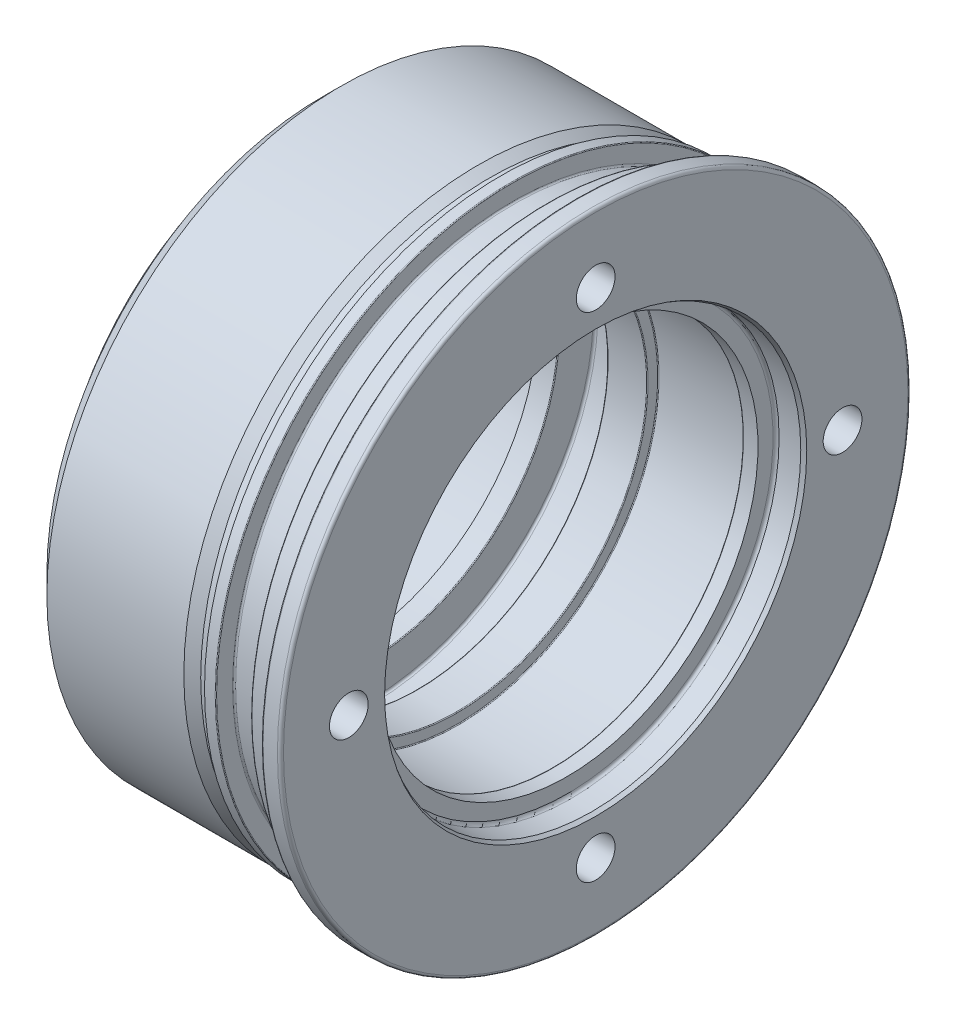
ISO-10303-21;
HEADER;
FILE_DESCRIPTION(('STEP AP214'),'2;1');
FILE_NAME('part.step','',(''),(''),'','','');
FILE_SCHEMA(('AUTOMOTIVE_DESIGN { 1 0 10303 214 1 1 1 1 }'));
ENDSEC;
DATA;
#1=APPLICATION_CONTEXT('core data for automotive mechanical design processes');
#2=APPLICATION_PROTOCOL_DEFINITION('international standard','automotive_design',2000,#1);
#3=PRODUCT_CONTEXT('',#1,'mechanical');
#4=PRODUCT('Part','Part','',(#3));
#5=PRODUCT_RELATED_PRODUCT_CATEGORY('part','',(#4));
#6=PRODUCT_DEFINITION_FORMATION('','',#4);
#7=PRODUCT_DEFINITION_CONTEXT('part definition',#1,'design');
#8=PRODUCT_DEFINITION('design','',#6,#7);
#9=PRODUCT_DEFINITION_SHAPE('','',#8);
#10=(LENGTH_UNIT() NAMED_UNIT(*) SI_UNIT(.MILLI.,.METRE.));
#11=(NAMED_UNIT(*) PLANE_ANGLE_UNIT() SI_UNIT($,.RADIAN.));
#12=(NAMED_UNIT(*) SI_UNIT($,.STERADIAN.) SOLID_ANGLE_UNIT());
#13=UNCERTAINTY_MEASURE_WITH_UNIT(LENGTH_MEASURE(1.E-05),#10,'distance_accuracy_value','');
#14=(GEOMETRIC_REPRESENTATION_CONTEXT(3) GLOBAL_UNCERTAINTY_ASSIGNED_CONTEXT((#13)) GLOBAL_UNIT_ASSIGNED_CONTEXT((#10,
#11,#12)) REPRESENTATION_CONTEXT('',''));
#15=CARTESIAN_POINT('',(0.,0.,0.));
#16=DIRECTION('',(0.,0.,1.));
#17=DIRECTION('',(1.,0.,0.));
#18=AXIS2_PLACEMENT_3D('',#15,#16,#17);
#19=CARTESIAN_POINT('',(-77.5,0.,0.));
#20=DIRECTION('',(-1.,0.,0.));
#21=DIRECTION('',(0.,0.,1.));
#22=AXIS2_PLACEMENT_3D('',#19,#20,#21);
#23=CYLINDRICAL_SURFACE('',#22,76.);
#24=CARTESIAN_POINT('',(-28.,0.,0.));
#25=DIRECTION('',(-1.,0.,0.));
#26=DIRECTION('',(0.,0.,1.));
#27=AXIS2_PLACEMENT_3D('',#24,#25,#26);
#28=CIRCLE('',#27,76.);
#29=CARTESIAN_POINT('',(-28.,0.,76.));
#30=VERTEX_POINT('',#29);
#31=EDGE_CURVE('E11',#30,#30,#28,.T.);
#32=ORIENTED_EDGE('',*,*,#31,.F.);
#33=EDGE_LOOP('',(#32));
#34=FACE_BOUND('',#33,.T.);
#35=CARTESIAN_POINT('',(-25.,0.,0.));
#36=DIRECTION('',(-1.,0.,0.));
#37=DIRECTION('',(0.,0.,1.));
#38=AXIS2_PLACEMENT_3D('',#35,#36,#37);
#39=CIRCLE('',#38,76.);
#40=CARTESIAN_POINT('',(-25.,0.,76.));
#41=VERTEX_POINT('',#40);
#42=EDGE_CURVE('E98',#41,#41,#39,.T.);
#43=ORIENTED_EDGE('',*,*,#42,.T.);
#44=EDGE_LOOP('',(#43));
#45=FACE_BOUND('',#44,.T.);
#46=ADVANCED_FACE('F45',(#34,#45),#23,.T.);
#47=CARTESIAN_POINT('',(-28.,0.,0.));
#48=DIRECTION('',(-1.,0.,0.));
#49=DIRECTION('',(0.,0.,1.));
#50=AXIS2_PLACEMENT_3D('',#47,#48,#49);
#51=CONICAL_SURFACE('',#50,76.,0.471238898038469);
#52=CARTESIAN_POINT('',(-30.9439157582577,0.,0.));
#53=DIRECTION('',(-1.,0.,0.));
#54=DIRECTION('',(0.,0.,1.));
#55=AXIS2_PLACEMENT_3D('',#52,#53,#54);
#56=CIRCLE('',#55,77.5);
#57=CARTESIAN_POINT('',(-30.9439157582577,0.,77.5));
#58=VERTEX_POINT('',#57);
#59=EDGE_CURVE('E52',#58,#58,#56,.T.);
#60=ORIENTED_EDGE('',*,*,#59,.F.);
#61=EDGE_LOOP('',(#60));
#62=FACE_BOUND('',#61,.T.);
#63=ORIENTED_EDGE('',*,*,#31,.T.);
#64=EDGE_LOOP('',(#63));
#65=FACE_BOUND('',#64,.T.);
#66=ADVANCED_FACE('F234',(#62,#65),#51,.T.);
#67=CARTESIAN_POINT('',(-77.5,0.,0.));
#68=DIRECTION('',(-1.,0.,0.));
#69=DIRECTION('',(0.,0.,1.));
#70=AXIS2_PLACEMENT_3D('',#67,#68,#69);
#71=CYLINDRICAL_SURFACE('',#70,77.5);
#72=CARTESIAN_POINT('',(-66.9999999999999,0.,0.));
#73=DIRECTION('',(-1.,0.,0.));
#74=DIRECTION('',(0.,0.,1.));
#75=AXIS2_PLACEMENT_3D('',#72,#73,#74);
#76=CIRCLE('',#75,77.5);
#77=CARTESIAN_POINT('',(-66.9999999999999,0.,77.5));
#78=VERTEX_POINT('',#77);
#79=EDGE_CURVE('E227',#78,#78,#76,.T.);
#80=ORIENTED_EDGE('',*,*,#79,.F.);
#81=EDGE_LOOP('',(#80));
#82=FACE_BOUND('',#81,.T.);
#83=ORIENTED_EDGE('',*,*,#59,.T.);
#84=EDGE_LOOP('',(#83));
#85=FACE_BOUND('',#84,.T.);
#86=ADVANCED_FACE('F232',(#82,#85),#71,.T.);
#87=CARTESIAN_POINT('',(-72.,0.,0.));
#88=DIRECTION('',(1.,0.,0.));
#89=DIRECTION('',(0.,0.,-1.));
#90=AXIS2_PLACEMENT_3D('',#87,#88,#89);
#91=CONICAL_SURFACE('',#90,72.5,0.785398163397444);
#92=ORIENTED_EDGE('',*,*,#79,.T.);
#93=EDGE_LOOP('',(#92));
#94=FACE_BOUND('',#93,.T.);
#95=CARTESIAN_POINT('',(-72.,0.,0.));
#96=DIRECTION('',(-1.,0.,0.));
#97=DIRECTION('',(0.,0.,1.));
#98=AXIS2_PLACEMENT_3D('',#95,#96,#97);
#99=CIRCLE('',#98,72.5);
#100=CARTESIAN_POINT('',(-72.,0.,72.5));
#101=VERTEX_POINT('',#100);
#102=EDGE_CURVE('E224',#101,#101,#99,.T.);
#103=ORIENTED_EDGE('',*,*,#102,.F.);
#104=EDGE_LOOP('',(#103));
#105=FACE_BOUND('',#104,.T.);
#106=ADVANCED_FACE('F432',(#94,#105),#91,.T.);
#107=CARTESIAN_POINT('',(-72.,65.,0.));
#108=DIRECTION('',(-1.,0.,0.));
#109=DIRECTION('',(0.,0.,1.));
#110=AXIS2_PLACEMENT_3D('',#107,#108,#109);
#111=PLANE('',#110);
#112=ORIENTED_EDGE('',*,*,#102,.T.);
#113=EDGE_LOOP('',(#112));
#114=FACE_BOUND('',#113,.T.);
#115=CARTESIAN_POINT('',(-72.,0.,0.));
#116=DIRECTION('',(-1.,0.,0.));
#117=DIRECTION('',(0.,0.,1.));
#118=AXIS2_PLACEMENT_3D('',#115,#116,#117);
#119=CIRCLE('',#118,65.);
#120=CARTESIAN_POINT('',(-72.,0.,65.));
#121=VERTEX_POINT('',#120);
#122=EDGE_CURVE('E221',#121,#121,#119,.T.);
#123=ORIENTED_EDGE('',*,*,#122,.F.);
#124=EDGE_LOOP('',(#123));
#125=FACE_BOUND('',#124,.T.);
#126=ADVANCED_FACE('F428',(#114,#125),#111,.T.);
#127=CARTESIAN_POINT('',(-77.5,0.,0.));
#128=DIRECTION('',(-1.,0.,0.));
#129=DIRECTION('',(0.,0.,1.));
#130=AXIS2_PLACEMENT_3D('',#127,#128,#129);
#131=CYLINDRICAL_SURFACE('',#130,65.);
#132=ORIENTED_EDGE('',*,*,#122,.T.);
#133=EDGE_LOOP('',(#132));
#134=FACE_BOUND('',#133,.T.);
#135=CARTESIAN_POINT('',(-77.5,0.,0.));
#136=DIRECTION('',(-1.,0.,0.));
#137=DIRECTION('',(0.,0.,1.));
#138=AXIS2_PLACEMENT_3D('',#135,#136,#137);
#139=CIRCLE('',#138,65.);
#140=CARTESIAN_POINT('',(-77.5,0.,65.));
#141=VERTEX_POINT('',#140);
#142=EDGE_CURVE('E218',#141,#141,#139,.T.);
#143=ORIENTED_EDGE('',*,*,#142,.F.);
#144=EDGE_LOOP('',(#143));
#145=FACE_BOUND('',#144,.T.);
#146=ADVANCED_FACE('F424',(#134,#145),#131,.T.);
#147=CARTESIAN_POINT('',(-77.5,65.,0.));
#148=DIRECTION('',(1.,0.,0.));
#149=DIRECTION('',(0.,0.,-1.));
#150=AXIS2_PLACEMENT_3D('',#147,#148,#149);
#151=PLANE('',#150);
#152=CARTESIAN_POINT('',(-77.5,0.,0.));
#153=DIRECTION('',(-1.,0.,0.));
#154=DIRECTION('',(0.,0.,1.));
#155=AXIS2_PLACEMENT_3D('',#152,#153,#154);
#156=CIRCLE('',#155,52.);
#157=CARTESIAN_POINT('',(-77.5,0.,52.));
#158=VERTEX_POINT('',#157);
#159=EDGE_CURVE('E215',#158,#158,#156,.T.);
#160=ORIENTED_EDGE('',*,*,#159,.F.);
#161=EDGE_LOOP('',(#160));
#162=FACE_BOUND('',#161,.T.);
#163=ORIENTED_EDGE('',*,*,#142,.T.);
#164=EDGE_LOOP('',(#163));
#165=FACE_BOUND('',#164,.T.);
#166=ADVANCED_FACE('F420',(#162,#165),#151,.F.);
#167=CARTESIAN_POINT('',(-77.5,0.,0.));
#168=DIRECTION('',(-1.,0.,0.));
#169=DIRECTION('',(0.,0.,1.));
#170=AXIS2_PLACEMENT_3D('',#167,#168,#169);
#171=CYLINDRICAL_SURFACE('',#170,52.);
#172=CARTESIAN_POINT('',(-65.5,0.,0.));
#173=DIRECTION('',(-1.,0.,0.));
#174=DIRECTION('',(0.,0.,1.));
#175=AXIS2_PLACEMENT_3D('',#172,#173,#174);
#176=CIRCLE('',#175,52.);
#177=CARTESIAN_POINT('',(-65.5,0.,52.));
#178=VERTEX_POINT('',#177);
#179=EDGE_CURVE('E212',#178,#178,#176,.T.);
#180=ORIENTED_EDGE('',*,*,#179,.F.);
#181=EDGE_LOOP('',(#180));
#182=FACE_BOUND('',#181,.T.);
#183=ORIENTED_EDGE('',*,*,#159,.T.);
#184=EDGE_LOOP('',(#183));
#185=FACE_BOUND('',#184,.T.);
#186=ADVANCED_FACE('F416',(#182,#185),#171,.F.);
#187=CARTESIAN_POINT('',(-65.5,52.,0.));
#188=DIRECTION('',(1.,0.,0.));
#189=DIRECTION('',(0.,0.,-1.));
#190=AXIS2_PLACEMENT_3D('',#187,#188,#189);
#191=PLANE('',#190);
#192=CARTESIAN_POINT('',(-65.5,0.,0.));
#193=DIRECTION('',(-1.,0.,0.));
#194=DIRECTION('',(0.,0.,1.));
#195=AXIS2_PLACEMENT_3D('',#192,#193,#194);
#196=CIRCLE('',#195,50.25);
#197=CARTESIAN_POINT('',(-65.5,0.,50.25));
#198=VERTEX_POINT('',#197);
#199=EDGE_CURVE('E209',#198,#198,#196,.T.);
#200=ORIENTED_EDGE('',*,*,#199,.F.);
#201=EDGE_LOOP('',(#200));
#202=FACE_BOUND('',#201,.T.);
#203=ORIENTED_EDGE('',*,*,#179,.T.);
#204=EDGE_LOOP('',(#203));
#205=FACE_BOUND('',#204,.T.);
#206=ADVANCED_FACE('F412',(#202,#205),#191,.F.);
#207=CARTESIAN_POINT('',(-77.5,0.,0.));
#208=DIRECTION('',(-1.,0.,0.));
#209=DIRECTION('',(0.,0.,1.));
#210=AXIS2_PLACEMENT_3D('',#207,#208,#209);
#211=CYLINDRICAL_SURFACE('',#210,50.25);
#212=CARTESIAN_POINT('',(-60.2,0.,0.));
#213=DIRECTION('',(-1.,0.,0.));
#214=DIRECTION('',(0.,0.,1.));
#215=AXIS2_PLACEMENT_3D('',#212,#213,#214);
#216=CIRCLE('',#215,50.25);
#217=CARTESIAN_POINT('',(-60.2,0.,50.25));
#218=VERTEX_POINT('',#217);
#219=EDGE_CURVE('E206',#218,#218,#216,.T.);
#220=ORIENTED_EDGE('',*,*,#219,.F.);
#221=EDGE_LOOP('',(#220));
#222=FACE_BOUND('',#221,.T.);
#223=ORIENTED_EDGE('',*,*,#199,.T.);
#224=EDGE_LOOP('',(#223));
#225=FACE_BOUND('',#224,.T.);
#226=ADVANCED_FACE('F408',(#222,#225),#211,.F.);
#227=CARTESIAN_POINT('',(-60.2,0.,0.));
#228=DIRECTION('',(-1.,0.,0.));
#229=DIRECTION('',(0.,0.,1.));
#230=AXIS2_PLACEMENT_3D('',#227,#228,#229);
#231=TOROIDAL_SURFACE('',#230,50.45,0.199999999999999);
#232=CARTESIAN_POINT('',(-60.,0.,0.));
#233=DIRECTION('',(-1.,0.,0.));
#234=DIRECTION('',(0.,0.,1.));
#235=AXIS2_PLACEMENT_3D('',#232,#233,#234);
#236=CIRCLE('',#235,50.45);
#237=CARTESIAN_POINT('',(-60.,0.,50.45));
#238=VERTEX_POINT('',#237);
#239=EDGE_CURVE('E203',#238,#238,#236,.T.);
#240=ORIENTED_EDGE('',*,*,#239,.F.);
#241=EDGE_LOOP('',(#240));
#242=FACE_BOUND('',#241,.T.);
#243=ORIENTED_EDGE('',*,*,#219,.T.);
#244=EDGE_LOOP('',(#243));
#245=FACE_BOUND('',#244,.T.);
#246=ADVANCED_FACE('F404',(#242,#245),#231,.T.);
#247=CARTESIAN_POINT('',(-60.,50.45,0.));
#248=DIRECTION('',(-1.,0.,0.));
#249=DIRECTION('',(0.,0.,1.));
#250=AXIS2_PLACEMENT_3D('',#247,#248,#249);
#251=PLANE('',#250);
#252=CARTESIAN_POINT('',(-60.,0.,0.));
#253=DIRECTION('',(-1.,0.,0.));
#254=DIRECTION('',(0.,0.,1.));
#255=AXIS2_PLACEMENT_3D('',#252,#253,#254);
#256=CIRCLE('',#255,59.4);
#257=CARTESIAN_POINT('',(-60.,0.,59.4));
#258=VERTEX_POINT('',#257);
#259=EDGE_CURVE('E200',#258,#258,#256,.T.);
#260=ORIENTED_EDGE('',*,*,#259,.F.);
#261=EDGE_LOOP('',(#260));
#262=FACE_BOUND('',#261,.T.);
#263=ORIENTED_EDGE('',*,*,#239,.T.);
#264=EDGE_LOOP('',(#263));
#265=FACE_BOUND('',#264,.T.);
#266=ADVANCED_FACE('F400',(#262,#265),#251,.F.);
#267=CARTESIAN_POINT('',(-59.4,0.,0.));
#268=DIRECTION('',(-1.,0.,0.));
#269=DIRECTION('',(0.,0.,1.));
#270=AXIS2_PLACEMENT_3D('',#267,#268,#269);
#271=TOROIDAL_SURFACE('',#270,59.4,0.600000000000003);
#272=CARTESIAN_POINT('',(-59.4,0.,0.));
#273=DIRECTION('',(-1.,0.,0.));
#274=DIRECTION('',(0.,0.,1.));
#275=AXIS2_PLACEMENT_3D('',#272,#273,#274);
#276=CIRCLE('',#275,60.);
#277=CARTESIAN_POINT('',(-59.4,0.,60.));
#278=VERTEX_POINT('',#277);
#279=EDGE_CURVE('E197',#278,#278,#276,.T.);
#280=ORIENTED_EDGE('',*,*,#279,.F.);
#281=EDGE_LOOP('',(#280));
#282=FACE_BOUND('',#281,.T.);
#283=ORIENTED_EDGE('',*,*,#259,.T.);
#284=EDGE_LOOP('',(#283));
#285=FACE_BOUND('',#284,.T.);
#286=ADVANCED_FACE('F396',(#282,#285),#271,.F.);
#287=CARTESIAN_POINT('',(-77.5,0.,0.));
#288=DIRECTION('',(-1.,0.,0.));
#289=DIRECTION('',(0.,0.,1.));
#290=AXIS2_PLACEMENT_3D('',#287,#288,#289);
#291=CYLINDRICAL_SURFACE('',#290,60.);
#292=CARTESIAN_POINT('',(-47.6,0.,0.));
#293=DIRECTION('',(-1.,0.,0.));
#294=DIRECTION('',(0.,0.,1.));
#295=AXIS2_PLACEMENT_3D('',#292,#293,#294);
#296=CIRCLE('',#295,60.);
#297=CARTESIAN_POINT('',(-47.6,0.,60.));
#298=VERTEX_POINT('',#297);
#299=EDGE_CURVE('E194',#298,#298,#296,.T.);
#300=ORIENTED_EDGE('',*,*,#299,.F.);
#301=EDGE_LOOP('',(#300));
#302=FACE_BOUND('',#301,.T.);
#303=ORIENTED_EDGE('',*,*,#279,.T.);
#304=EDGE_LOOP('',(#303));
#305=FACE_BOUND('',#304,.T.);
#306=ADVANCED_FACE('F392',(#302,#305),#291,.F.);
#307=CARTESIAN_POINT('',(-47.6,0.,0.));
#308=DIRECTION('',(-1.,0.,0.));
#309=DIRECTION('',(0.,0.,1.));
#310=AXIS2_PLACEMENT_3D('',#307,#308,#309);
#311=TOROIDAL_SURFACE('',#310,59.4,0.600000000000003);
#312=CARTESIAN_POINT('',(-47.,0.,0.));
#313=DIRECTION('',(-1.,0.,0.));
#314=DIRECTION('',(0.,0.,1.));
#315=AXIS2_PLACEMENT_3D('',#312,#313,#314);
#316=CIRCLE('',#315,59.4);
#317=CARTESIAN_POINT('',(-47.,0.,59.4));
#318=VERTEX_POINT('',#317);
#319=EDGE_CURVE('E191',#318,#318,#316,.T.);
#320=ORIENTED_EDGE('',*,*,#319,.F.);
#321=EDGE_LOOP('',(#320));
#322=FACE_BOUND('',#321,.T.);
#323=ORIENTED_EDGE('',*,*,#299,.T.);
#324=EDGE_LOOP('',(#323));
#325=FACE_BOUND('',#324,.T.);
#326=ADVANCED_FACE('F388',(#322,#325),#311,.F.);
#327=CARTESIAN_POINT('',(-47.,59.4,0.));
#328=DIRECTION('',(1.,0.,0.));
#329=DIRECTION('',(0.,0.,-1.));
#330=AXIS2_PLACEMENT_3D('',#327,#328,#329);
#331=PLANE('',#330);
#332=CARTESIAN_POINT('',(-47.,0.,0.));
#333=DIRECTION('',(-1.,0.,0.));
#334=DIRECTION('',(0.,0.,1.));
#335=AXIS2_PLACEMENT_3D('',#332,#333,#334);
#336=CIRCLE('',#335,50.3);
#337=CARTESIAN_POINT('',(-47.,0.,50.3));
#338=VERTEX_POINT('',#337);
#339=EDGE_CURVE('E188',#338,#338,#336,.T.);
#340=ORIENTED_EDGE('',*,*,#339,.F.);
#341=EDGE_LOOP('',(#340));
#342=FACE_BOUND('',#341,.T.);
#343=ORIENTED_EDGE('',*,*,#319,.T.);
#344=EDGE_LOOP('',(#343));
#345=FACE_BOUND('',#344,.T.);
#346=ADVANCED_FACE('F384',(#342,#345),#331,.F.);
#347=CARTESIAN_POINT('',(-46.8,0.,0.));
#348=DIRECTION('',(-1.,0.,0.));
#349=DIRECTION('',(0.,0.,1.));
#350=AXIS2_PLACEMENT_3D('',#347,#348,#349);
#351=TOROIDAL_SURFACE('',#350,50.3,0.199999999999999);
#352=CARTESIAN_POINT('',(-46.8,0.,0.));
#353=DIRECTION('',(-1.,0.,0.));
#354=DIRECTION('',(0.,0.,1.));
#355=AXIS2_PLACEMENT_3D('',#352,#353,#354);
#356=CIRCLE('',#355,50.1);
#357=CARTESIAN_POINT('',(-46.8,0.,50.1));
#358=VERTEX_POINT('',#357);
#359=EDGE_CURVE('E185',#358,#358,#356,.T.);
#360=ORIENTED_EDGE('',*,*,#359,.F.);
#361=EDGE_LOOP('',(#360));
#362=FACE_BOUND('',#361,.T.);
#363=ORIENTED_EDGE('',*,*,#339,.T.);
#364=EDGE_LOOP('',(#363));
#365=FACE_BOUND('',#364,.T.);
#366=ADVANCED_FACE('F380',(#362,#365),#351,.T.);
#367=CARTESIAN_POINT('',(-77.5,0.,0.));
#368=DIRECTION('',(-1.,0.,0.));
#369=DIRECTION('',(0.,0.,1.));
#370=AXIS2_PLACEMENT_3D('',#367,#368,#369);
#371=CYLINDRICAL_SURFACE('',#370,50.1);
#372=CARTESIAN_POINT('',(-36.7,0.,0.));
#373=DIRECTION('',(-1.,0.,0.));
#374=DIRECTION('',(0.,0.,1.));
#375=AXIS2_PLACEMENT_3D('',#372,#373,#374);
#376=CIRCLE('',#375,50.1);
#377=CARTESIAN_POINT('',(-36.7,0.,50.1));
#378=VERTEX_POINT('',#377);
#379=EDGE_CURVE('E182',#378,#378,#376,.T.);
#380=ORIENTED_EDGE('',*,*,#379,.F.);
#381=EDGE_LOOP('',(#380));
#382=FACE_BOUND('',#381,.T.);
#383=ORIENTED_EDGE('',*,*,#359,.T.);
#384=EDGE_LOOP('',(#383));
#385=FACE_BOUND('',#384,.T.);
#386=ADVANCED_FACE('F376',(#382,#385),#371,.F.);
#387=CARTESIAN_POINT('',(-36.7,0.,0.));
#388=DIRECTION('',(-1.,0.,0.));
#389=DIRECTION('',(0.,0.,1.));
#390=AXIS2_PLACEMENT_3D('',#387,#388,#389);
#391=TOROIDAL_SURFACE('',#390,50.3,0.199999999999999);
#392=CARTESIAN_POINT('',(-36.5,0.,0.));
#393=DIRECTION('',(-1.,0.,0.));
#394=DIRECTION('',(0.,0.,1.));
#395=AXIS2_PLACEMENT_3D('',#392,#393,#394);
#396=CIRCLE('',#395,50.3);
#397=CARTESIAN_POINT('',(-36.5,0.,50.3));
#398=VERTEX_POINT('',#397);
#399=EDGE_CURVE('E179',#398,#398,#396,.T.);
#400=ORIENTED_EDGE('',*,*,#399,.F.);
#401=EDGE_LOOP('',(#400));
#402=FACE_BOUND('',#401,.T.);
#403=ORIENTED_EDGE('',*,*,#379,.T.);
#404=EDGE_LOOP('',(#403));
#405=FACE_BOUND('',#404,.T.);
#406=ADVANCED_FACE('F372',(#402,#405),#391,.T.);
#407=CARTESIAN_POINT('',(-36.5,50.3,0.));
#408=DIRECTION('',(-1.,0.,0.));
#409=DIRECTION('',(0.,0.,1.));
#410=AXIS2_PLACEMENT_3D('',#407,#408,#409);
#411=PLANE('',#410);
#412=CARTESIAN_POINT('',(-36.5,0.,0.));
#413=DIRECTION('',(-1.,0.,0.));
#414=DIRECTION('',(0.,0.,1.));
#415=AXIS2_PLACEMENT_3D('',#412,#413,#414);
#416=CIRCLE('',#415,52.8);
#417=CARTESIAN_POINT('',(-36.5,0.,52.8));
#418=VERTEX_POINT('',#417);
#419=EDGE_CURVE('E176',#418,#418,#416,.T.);
#420=ORIENTED_EDGE('',*,*,#419,.F.);
#421=EDGE_LOOP('',(#420));
#422=FACE_BOUND('',#421,.T.);
#423=ORIENTED_EDGE('',*,*,#399,.T.);
#424=EDGE_LOOP('',(#423));
#425=FACE_BOUND('',#424,.T.);
#426=ADVANCED_FACE('F368',(#422,#425),#411,.F.);
#427=CARTESIAN_POINT('',(-36.3,0.,0.));
#428=DIRECTION('',(-1.,0.,0.));
#429=DIRECTION('',(0.,0.,1.));
#430=AXIS2_PLACEMENT_3D('',#427,#428,#429);
#431=TOROIDAL_SURFACE('',#430,52.8,0.199999999999999);
#432=CARTESIAN_POINT('',(-36.3,0.,0.));
#433=DIRECTION('',(-1.,0.,0.));
#434=DIRECTION('',(0.,0.,1.));
#435=AXIS2_PLACEMENT_3D('',#432,#433,#434);
#436=CIRCLE('',#435,53.);
#437=CARTESIAN_POINT('',(-36.3,0.,53.));
#438=VERTEX_POINT('',#437);
#439=EDGE_CURVE('E173',#438,#438,#436,.T.);
#440=ORIENTED_EDGE('',*,*,#439,.F.);
#441=EDGE_LOOP('',(#440));
#442=FACE_BOUND('',#441,.T.);
#443=ORIENTED_EDGE('',*,*,#419,.T.);
#444=EDGE_LOOP('',(#443));
#445=FACE_BOUND('',#444,.T.);
#446=ADVANCED_FACE('F364',(#442,#445),#431,.F.);
#447=CARTESIAN_POINT('',(-77.5,0.,0.));
#448=DIRECTION('',(-1.,0.,0.));
#449=DIRECTION('',(0.,0.,1.));
#450=AXIS2_PLACEMENT_3D('',#447,#448,#449);
#451=CYLINDRICAL_SURFACE('',#450,53.);
#452=CARTESIAN_POINT('',(-11.7,0.,0.));
#453=DIRECTION('',(-1.,0.,0.));
#454=DIRECTION('',(0.,0.,1.));
#455=AXIS2_PLACEMENT_3D('',#452,#453,#454);
#456=CIRCLE('',#455,53.);
#457=CARTESIAN_POINT('',(-11.7,0.,53.));
#458=VERTEX_POINT('',#457);
#459=EDGE_CURVE('E170',#458,#458,#456,.T.);
#460=ORIENTED_EDGE('',*,*,#459,.F.);
#461=EDGE_LOOP('',(#460));
#462=FACE_BOUND('',#461,.T.);
#463=ORIENTED_EDGE('',*,*,#439,.T.);
#464=EDGE_LOOP('',(#463));
#465=FACE_BOUND('',#464,.T.);
#466=ADVANCED_FACE('F360',(#462,#465),#451,.F.);
#467=CARTESIAN_POINT('',(-11.7,0.,0.));
#468=DIRECTION('',(-1.,0.,0.));
#469=DIRECTION('',(0.,0.,1.));
#470=AXIS2_PLACEMENT_3D('',#467,#468,#469);
#471=TOROIDAL_SURFACE('',#470,52.8,0.199999999999998);
#472=CARTESIAN_POINT('',(-11.5,0.,0.));
#473=DIRECTION('',(-1.,0.,0.));
#474=DIRECTION('',(0.,0.,1.));
#475=AXIS2_PLACEMENT_3D('',#472,#473,#474);
#476=CIRCLE('',#475,52.8);
#477=CARTESIAN_POINT('',(-11.5,0.,52.8));
#478=VERTEX_POINT('',#477);
#479=EDGE_CURVE('E167',#478,#478,#476,.T.);
#480=ORIENTED_EDGE('',*,*,#479,.F.);
#481=EDGE_LOOP('',(#480));
#482=FACE_BOUND('',#481,.T.);
#483=ORIENTED_EDGE('',*,*,#459,.T.);
#484=EDGE_LOOP('',(#483));
#485=FACE_BOUND('',#484,.T.);
#486=ADVANCED_FACE('F356',(#482,#485),#471,.F.);
#487=CARTESIAN_POINT('',(-11.5,52.8,0.));
#488=DIRECTION('',(1.,0.,0.));
#489=DIRECTION('',(0.,0.,-1.));
#490=AXIS2_PLACEMENT_3D('',#487,#488,#489);
#491=PLANE('',#490);
#492=CARTESIAN_POINT('',(-11.5,0.,0.));
#493=DIRECTION('',(-1.,0.,0.));
#494=DIRECTION('',(0.,0.,1.));
#495=AXIS2_PLACEMENT_3D('',#492,#493,#494);
#496=CIRCLE('',#495,50.45);
#497=CARTESIAN_POINT('',(-11.5,0.,50.45));
#498=VERTEX_POINT('',#497);
#499=EDGE_CURVE('E164',#498,#498,#496,.T.);
#500=ORIENTED_EDGE('',*,*,#499,.F.);
#501=EDGE_LOOP('',(#500));
#502=FACE_BOUND('',#501,.T.);
#503=ORIENTED_EDGE('',*,*,#479,.T.);
#504=EDGE_LOOP('',(#503));
#505=FACE_BOUND('',#504,.T.);
#506=ADVANCED_FACE('F352',(#502,#505),#491,.F.);
#507=CARTESIAN_POINT('',(-11.3,0.,0.));
#508=DIRECTION('',(-1.,0.,0.));
#509=DIRECTION('',(0.,0.,1.));
#510=AXIS2_PLACEMENT_3D('',#507,#508,#509);
#511=TOROIDAL_SURFACE('',#510,50.45,0.2);
#512=CARTESIAN_POINT('',(-11.3,0.,0.));
#513=DIRECTION('',(-1.,0.,0.));
#514=DIRECTION('',(0.,0.,1.));
#515=AXIS2_PLACEMENT_3D('',#512,#513,#514);
#516=CIRCLE('',#515,50.25);
#517=CARTESIAN_POINT('',(-11.3,0.,50.25));
#518=VERTEX_POINT('',#517);
#519=EDGE_CURVE('E161',#518,#518,#516,.T.);
#520=ORIENTED_EDGE('',*,*,#519,.F.);
#521=EDGE_LOOP('',(#520));
#522=FACE_BOUND('',#521,.T.);
#523=ORIENTED_EDGE('',*,*,#499,.T.);
#524=EDGE_LOOP('',(#523));
#525=FACE_BOUND('',#524,.T.);
#526=ADVANCED_FACE('F348',(#522,#525),#511,.T.);
#527=CARTESIAN_POINT('',(-77.5,0.,0.));
#528=DIRECTION('',(-1.,0.,0.));
#529=DIRECTION('',(0.,0.,1.));
#530=AXIS2_PLACEMENT_3D('',#527,#528,#529);
#531=CYLINDRICAL_SURFACE('',#530,50.25);
#532=CARTESIAN_POINT('',(-7.50000000000001,0.,0.));
#533=DIRECTION('',(-1.,0.,0.));
#534=DIRECTION('',(0.,0.,1.));
#535=AXIS2_PLACEMENT_3D('',#532,#533,#534);
#536=CIRCLE('',#535,50.25);
#537=CARTESIAN_POINT('',(-7.50000000000001,0.,50.25));
#538=VERTEX_POINT('',#537);
#539=EDGE_CURVE('E158',#538,#538,#536,.T.);
#540=ORIENTED_EDGE('',*,*,#539,.F.);
#541=EDGE_LOOP('',(#540));
#542=FACE_BOUND('',#541,.T.);
#543=ORIENTED_EDGE('',*,*,#519,.T.);
#544=EDGE_LOOP('',(#543));
#545=FACE_BOUND('',#544,.T.);
#546=ADVANCED_FACE('F344',(#542,#545),#531,.F.);
#547=CARTESIAN_POINT('',(-7.5,50.25,0.));
#548=DIRECTION('',(-1.,0.,0.));
#549=DIRECTION('',(0.,0.,1.));
#550=AXIS2_PLACEMENT_3D('',#547,#548,#549);
#551=PLANE('',#550);
#552=CARTESIAN_POINT('',(-7.50000000000001,0.,0.));
#553=DIRECTION('',(-1.,0.,0.));
#554=DIRECTION('',(0.,0.,1.));
#555=AXIS2_PLACEMENT_3D('',#552,#553,#554);
#556=CIRCLE('',#555,54.2);
#557=CARTESIAN_POINT('',(-7.50000000000001,0.,54.2));
#558=VERTEX_POINT('',#557);
#559=EDGE_CURVE('E155',#558,#558,#556,.T.);
#560=ORIENTED_EDGE('',*,*,#559,.F.);
#561=EDGE_LOOP('',(#560));
#562=FACE_BOUND('',#561,.T.);
#563=ORIENTED_EDGE('',*,*,#539,.T.);
#564=EDGE_LOOP('',(#563));
#565=FACE_BOUND('',#564,.T.);
#566=ADVANCED_FACE('F340',(#562,#565),#551,.F.);
#567=CARTESIAN_POINT('',(-6.7,0.,0.));
#568=DIRECTION('',(-1.,0.,0.));
#569=DIRECTION('',(0.,0.,1.));
#570=AXIS2_PLACEMENT_3D('',#567,#568,#569);
#571=TOROIDAL_SURFACE('',#570,54.2,0.800000000000001);
#572=CARTESIAN_POINT('',(-6.7,0.,0.));
#573=DIRECTION('',(-1.,0.,0.));
#574=DIRECTION('',(0.,0.,1.));
#575=AXIS2_PLACEMENT_3D('',#572,#573,#574);
#576=CIRCLE('',#575,55.);
#577=CARTESIAN_POINT('',(-6.7,0.,55.));
#578=VERTEX_POINT('',#577);
#579=EDGE_CURVE('E152',#578,#578,#576,.T.);
#580=ORIENTED_EDGE('',*,*,#579,.F.);
#581=EDGE_LOOP('',(#580));
#582=FACE_BOUND('',#581,.T.);
#583=ORIENTED_EDGE('',*,*,#559,.T.);
#584=EDGE_LOOP('',(#583));
#585=FACE_BOUND('',#584,.T.);
#586=ADVANCED_FACE('F336',(#582,#585),#571,.F.);
#587=CARTESIAN_POINT('',(-77.5,0.,0.));
#588=DIRECTION('',(-1.,0.,0.));
#589=DIRECTION('',(0.,0.,1.));
#590=AXIS2_PLACEMENT_3D('',#587,#588,#589);
#591=CYLINDRICAL_SURFACE('',#590,55.);
#592=CARTESIAN_POINT('',(-1.,0.,0.));
#593=DIRECTION('',(-1.,0.,0.));
#594=DIRECTION('',(0.,0.,1.));
#595=AXIS2_PLACEMENT_3D('',#592,#593,#594);
#596=CIRCLE('',#595,55.);
#597=CARTESIAN_POINT('',(-1.,0.,55.));
#598=VERTEX_POINT('',#597);
#599=EDGE_CURVE('E149',#598,#598,#596,.T.);
#600=ORIENTED_EDGE('',*,*,#599,.F.);
#601=EDGE_LOOP('',(#600));
#602=FACE_BOUND('',#601,.T.);
#603=ORIENTED_EDGE('',*,*,#579,.T.);
#604=EDGE_LOOP('',(#603));
#605=FACE_BOUND('',#604,.T.);
#606=ADVANCED_FACE('F332',(#602,#605),#591,.F.);
#607=CARTESIAN_POINT('',(-1.,0.,0.));
#608=DIRECTION('',(1.,0.,0.));
#609=DIRECTION('',(0.,0.,-1.));
#610=AXIS2_PLACEMENT_3D('',#607,#608,#609);
#611=CONICAL_SURFACE('',#610,55.,0.523598775598299);
#612=CARTESIAN_POINT('',(0.,0.,0.));
#613=DIRECTION('',(-1.,0.,0.));
#614=DIRECTION('',(0.,0.,1.));
#615=AXIS2_PLACEMENT_3D('',#612,#613,#614);
#616=CIRCLE('',#615,55.5773502691896);
#617=CARTESIAN_POINT('',(0.,0.,55.5773502691896));
#618=VERTEX_POINT('',#617);
#619=EDGE_CURVE('E146',#618,#618,#616,.T.);
#620=ORIENTED_EDGE('',*,*,#619,.F.);
#621=EDGE_LOOP('',(#620));
#622=FACE_BOUND('',#621,.T.);
#623=ORIENTED_EDGE('',*,*,#599,.T.);
#624=EDGE_LOOP('',(#623));
#625=FACE_BOUND('',#624,.T.);
#626=ADVANCED_FACE('F328',(#622,#625),#611,.F.);
#627=CARTESIAN_POINT('',(0.,55.5773502691896,0.));
#628=DIRECTION('',(-1.,0.,0.));
#629=DIRECTION('',(0.,0.,1.));
#630=AXIS2_PLACEMENT_3D('',#627,#628,#629);
#631=PLANE('',#630);
#632=CARTESIAN_POINT('',(0.,65.,0.));
#633=DIRECTION('',(1.,0.,0.));
#634=DIRECTION('',(0.,0.,-1.));
#635=AXIS2_PLACEMENT_3D('',#632,#633,#634);
#636=CIRCLE('',#635,5.09999999999999);
#637=CARTESIAN_POINT('',(0.,65.,-5.09999999999999));
#638=VERTEX_POINT('',#637);
#639=EDGE_CURVE('E76',#638,#638,#636,.T.);
#640=ORIENTED_EDGE('',*,*,#639,.F.);
#641=EDGE_LOOP('',(#640));
#642=FACE_BOUND('',#641,.T.);
#643=CARTESIAN_POINT('',(0.,0.,-65.));
#644=DIRECTION('',(1.,0.,0.));
#645=DIRECTION('',(0.,0.,-1.));
#646=AXIS2_PLACEMENT_3D('',#643,#644,#645);
#647=CIRCLE('',#646,5.1);
#648=CARTESIAN_POINT('',(0.,0.,-70.1));
#649=VERTEX_POINT('',#648);
#650=EDGE_CURVE('E75',#649,#649,#647,.T.);
#651=ORIENTED_EDGE('',*,*,#650,.F.);
#652=EDGE_LOOP('',(#651));
#653=FACE_BOUND('',#652,.T.);
#654=CARTESIAN_POINT('',(0.,-65.,0.));
#655=DIRECTION('',(1.,0.,0.));
#656=DIRECTION('',(0.,0.,-1.));
#657=AXIS2_PLACEMENT_3D('',#654,#655,#656);
#658=CIRCLE('',#657,5.1);
#659=CARTESIAN_POINT('',(0.,-65.,-5.1));
#660=VERTEX_POINT('',#659);
#661=EDGE_CURVE('E86',#660,#660,#658,.T.);
#662=ORIENTED_EDGE('',*,*,#661,.F.);
#663=EDGE_LOOP('',(#662));
#664=FACE_BOUND('',#663,.T.);
#665=CARTESIAN_POINT('',(0.,0.,65.));
#666=DIRECTION('',(1.,0.,0.));
#667=DIRECTION('',(0.,0.,-1.));
#668=AXIS2_PLACEMENT_3D('',#665,#666,#667);
#669=CIRCLE('',#668,5.1);
#670=CARTESIAN_POINT('',(0.,0.,59.9));
#671=VERTEX_POINT('',#670);
#672=EDGE_CURVE('E92',#671,#671,#669,.T.);
#673=ORIENTED_EDGE('',*,*,#672,.F.);
#674=EDGE_LOOP('',(#673));
#675=FACE_BOUND('',#674,.T.);
#676=CARTESIAN_POINT('',(0.,0.,0.));
#677=DIRECTION('',(-1.,0.,0.));
#678=DIRECTION('',(0.,0.,1.));
#679=AXIS2_PLACEMENT_3D('',#676,#677,#678);
#680=CIRCLE('',#679,82.2);
#681=CARTESIAN_POINT('',(0.,0.,82.2));
#682=VERTEX_POINT('',#681);
#683=EDGE_CURVE('E143',#682,#682,#680,.T.);
#684=ORIENTED_EDGE('',*,*,#683,.F.);
#685=EDGE_LOOP('',(#684));
#686=FACE_BOUND('',#685,.T.);
#687=ORIENTED_EDGE('',*,*,#619,.T.);
#688=EDGE_LOOP('',(#687));
#689=FACE_BOUND('',#688,.T.);
#690=ADVANCED_FACE('F324',(#642,#653,#664,#675,#686,#689),#631,.F.);
#691=CARTESIAN_POINT('',(-0.8,0.,0.));
#692=DIRECTION('',(-1.,0.,0.));
#693=DIRECTION('',(0.,0.,1.));
#694=AXIS2_PLACEMENT_3D('',#691,#692,#693);
#695=TOROIDAL_SURFACE('',#694,82.2,0.799999999999997);
#696=CARTESIAN_POINT('',(-0.799999999999995,0.,0.));
#697=DIRECTION('',(-1.,0.,0.));
#698=DIRECTION('',(0.,0.,1.));
#699=AXIS2_PLACEMENT_3D('',#696,#697,#698);
#700=CIRCLE('',#699,83.);
#701=CARTESIAN_POINT('',(-0.799999999999995,0.,83.));
#702=VERTEX_POINT('',#701);
#703=EDGE_CURVE('E140',#702,#702,#700,.T.);
#704=ORIENTED_EDGE('',*,*,#703,.F.);
#705=EDGE_LOOP('',(#704));
#706=FACE_BOUND('',#705,.T.);
#707=ORIENTED_EDGE('',*,*,#683,.T.);
#708=EDGE_LOOP('',(#707));
#709=FACE_BOUND('',#708,.T.);
#710=ADVANCED_FACE('F320',(#706,#709),#695,.T.);
#711=CARTESIAN_POINT('',(-77.5,0.,0.));
#712=DIRECTION('',(-1.,0.,0.));
#713=DIRECTION('',(0.,0.,1.));
#714=AXIS2_PLACEMENT_3D('',#711,#712,#713);
#715=CYLINDRICAL_SURFACE('',#714,83.);
#716=CARTESIAN_POINT('',(-4.60000000000005,0.,0.));
#717=DIRECTION('',(-1.,0.,0.));
#718=DIRECTION('',(0.,0.,1.));
#719=AXIS2_PLACEMENT_3D('',#716,#717,#718);
#720=CIRCLE('',#719,83.);
#721=CARTESIAN_POINT('',(-4.60000000000005,0.,83.));
#722=VERTEX_POINT('',#721);
#723=EDGE_CURVE('E137',#722,#722,#720,.T.);
#724=ORIENTED_EDGE('',*,*,#723,.F.);
#725=EDGE_LOOP('',(#724));
#726=FACE_BOUND('',#725,.T.);
#727=ORIENTED_EDGE('',*,*,#703,.T.);
#728=EDGE_LOOP('',(#727));
#729=FACE_BOUND('',#728,.T.);
#730=ADVANCED_FACE('F316',(#726,#729),#715,.T.);
#731=CARTESIAN_POINT('',(-4.60000000000005,0.,0.));
#732=DIRECTION('',(-1.,0.,0.));
#733=DIRECTION('',(0.,0.,1.));
#734=AXIS2_PLACEMENT_3D('',#731,#732,#733);
#735=TOROIDAL_SURFACE('',#734,82.6,0.399999999999998);
#736=CARTESIAN_POINT('',(-5.00000000000005,0.,0.));
#737=DIRECTION('',(-1.,0.,0.));
#738=DIRECTION('',(0.,0.,1.));
#739=AXIS2_PLACEMENT_3D('',#736,#737,#738);
#740=CIRCLE('',#739,82.6);
#741=CARTESIAN_POINT('',(-5.00000000000005,0.,82.6));
#742=VERTEX_POINT('',#741);
#743=EDGE_CURVE('E134',#742,#742,#740,.T.);
#744=ORIENTED_EDGE('',*,*,#743,.F.);
#745=EDGE_LOOP('',(#744));
#746=FACE_BOUND('',#745,.T.);
#747=ORIENTED_EDGE('',*,*,#723,.T.);
#748=EDGE_LOOP('',(#747));
#749=FACE_BOUND('',#748,.T.);
#750=ADVANCED_FACE('F312',(#746,#749),#735,.T.);
#751=CARTESIAN_POINT('',(-5.00000000000004,78.8,0.));
#752=DIRECTION('',(-1.,0.,0.));
#753=DIRECTION('',(0.,0.,1.));
#754=AXIS2_PLACEMENT_3D('',#751,#752,#753);
#755=PLANE('',#754);
#756=ORIENTED_EDGE('',*,*,#743,.T.);
#757=EDGE_LOOP('',(#756));
#758=FACE_BOUND('',#757,.T.);
#759=CARTESIAN_POINT('',(-5.00000000000005,0.,0.));
#760=DIRECTION('',(-1.,0.,0.));
#761=DIRECTION('',(0.,0.,1.));
#762=AXIS2_PLACEMENT_3D('',#759,#760,#761);
#763=CIRCLE('',#762,78.8);
#764=CARTESIAN_POINT('',(-5.00000000000005,0.,78.8));
#765=VERTEX_POINT('',#764);
#766=EDGE_CURVE('E131',#765,#765,#763,.T.);
#767=ORIENTED_EDGE('',*,*,#766,.F.);
#768=EDGE_LOOP('',(#767));
#769=FACE_BOUND('',#768,.T.);
#770=ADVANCED_FACE('F306',(#758,#769),#755,.T.);
#771=CARTESIAN_POINT('',(-5.80000000000005,0.,0.));
#772=DIRECTION('',(-1.,0.,0.));
#773=DIRECTION('',(0.,0.,1.));
#774=AXIS2_PLACEMENT_3D('',#771,#772,#773);
#775=TOROIDAL_SURFACE('',#774,78.8,0.800000000000005);
#776=ORIENTED_EDGE('',*,*,#766,.T.);
#777=EDGE_LOOP('',(#776));
#778=FACE_BOUND('',#777,.T.);
#779=CARTESIAN_POINT('',(-5.80000000000005,0.,0.));
#780=DIRECTION('',(-1.,0.,0.));
#781=DIRECTION('',(0.,0.,1.));
#782=AXIS2_PLACEMENT_3D('',#779,#780,#781);
#783=CIRCLE('',#782,78.);
#784=CARTESIAN_POINT('',(-5.80000000000005,0.,78.));
#785=VERTEX_POINT('',#784);
#786=EDGE_CURVE('E128',#785,#785,#783,.T.);
#787=ORIENTED_EDGE('',*,*,#786,.F.);
#788=EDGE_LOOP('',(#787));
#789=FACE_BOUND('',#788,.T.);
#790=ADVANCED_FACE('F300',(#778,#789),#775,.F.);
#791=CARTESIAN_POINT('',(-77.5,0.,0.));
#792=DIRECTION('',(-1.,0.,0.));
#793=DIRECTION('',(0.,0.,1.));
#794=AXIS2_PLACEMENT_3D('',#791,#792,#793);
#795=CYLINDRICAL_SURFACE('',#794,78.);
#796=ORIENTED_EDGE('',*,*,#786,.T.);
#797=EDGE_LOOP('',(#796));
#798=FACE_BOUND('',#797,.T.);
#799=CARTESIAN_POINT('',(-12.5,0.,0.));
#800=DIRECTION('',(-1.,0.,0.));
#801=DIRECTION('',(0.,0.,1.));
#802=AXIS2_PLACEMENT_3D('',#799,#800,#801);
#803=CIRCLE('',#802,78.);
#804=CARTESIAN_POINT('',(-12.5,0.,78.));
#805=VERTEX_POINT('',#804);
#806=EDGE_CURVE('E125',#805,#805,#803,.T.);
#807=ORIENTED_EDGE('',*,*,#806,.F.);
#808=EDGE_LOOP('',(#807));
#809=FACE_BOUND('',#808,.T.);
#810=ADVANCED_FACE('F295',(#798,#809),#795,.T.);
#811=CARTESIAN_POINT('',(-12.5,0.,0.));
#812=DIRECTION('',(-1.,0.,0.));
#813=DIRECTION('',(0.,0.,1.));
#814=AXIS2_PLACEMENT_3D('',#811,#812,#813);
#815=TOROIDAL_SURFACE('',#814,77.8,0.200000000000003);
#816=CARTESIAN_POINT('',(-12.7,0.,0.));
#817=DIRECTION('',(-1.,0.,0.));
#818=DIRECTION('',(0.,0.,1.));
#819=AXIS2_PLACEMENT_3D('',#816,#817,#818);
#820=CIRCLE('',#819,77.8);
#821=CARTESIAN_POINT('',(-12.7,0.,77.8));
#822=VERTEX_POINT('',#821);
#823=EDGE_CURVE('E122',#822,#822,#820,.T.);
#824=ORIENTED_EDGE('',*,*,#823,.F.);
#825=EDGE_LOOP('',(#824));
#826=FACE_BOUND('',#825,.T.);
#827=ORIENTED_EDGE('',*,*,#806,.T.);
#828=EDGE_LOOP('',(#827));
#829=FACE_BOUND('',#828,.T.);
#830=ADVANCED_FACE('F289',(#826,#829),#815,.T.);
#831=CARTESIAN_POINT('',(-12.7,77.8,0.));
#832=DIRECTION('',(1.,0.,0.));
#833=DIRECTION('',(0.,0.,-1.));
#834=AXIS2_PLACEMENT_3D('',#831,#832,#833);
#835=PLANE('',#834);
#836=CARTESIAN_POINT('',(-12.7,0.,0.));
#837=DIRECTION('',(-1.,0.,0.));
#838=DIRECTION('',(0.,0.,1.));
#839=AXIS2_PLACEMENT_3D('',#836,#837,#838);
#840=CIRCLE('',#839,73.6);
#841=CARTESIAN_POINT('',(-12.7,0.,73.6));
#842=VERTEX_POINT('',#841);
#843=EDGE_CURVE('E119',#842,#842,#840,.T.);
#844=ORIENTED_EDGE('',*,*,#843,.F.);
#845=EDGE_LOOP('',(#844));
#846=FACE_BOUND('',#845,.T.);
#847=ORIENTED_EDGE('',*,*,#823,.T.);
#848=EDGE_LOOP('',(#847));
#849=FACE_BOUND('',#848,.T.);
#850=ADVANCED_FACE('F283',(#846,#849),#835,.F.);
#851=CARTESIAN_POINT('',(-13.1,0.,0.));
#852=DIRECTION('',(-1.,0.,0.));
#853=DIRECTION('',(0.,0.,1.));
#854=AXIS2_PLACEMENT_3D('',#851,#852,#853);
#855=TOROIDAL_SURFACE('',#854,73.6,0.399999999999998);
#856=CARTESIAN_POINT('',(-13.1,0.,0.));
#857=DIRECTION('',(-1.,0.,0.));
#858=DIRECTION('',(0.,0.,1.));
#859=AXIS2_PLACEMENT_3D('',#856,#857,#858);
#860=CIRCLE('',#859,73.2);
#861=CARTESIAN_POINT('',(-13.1,0.,73.2));
#862=VERTEX_POINT('',#861);
#863=EDGE_CURVE('E116',#862,#862,#860,.T.);
#864=ORIENTED_EDGE('',*,*,#863,.F.);
#865=EDGE_LOOP('',(#864));
#866=FACE_BOUND('',#865,.T.);
#867=ORIENTED_EDGE('',*,*,#843,.T.);
#868=EDGE_LOOP('',(#867));
#869=FACE_BOUND('',#868,.T.);
#870=ADVANCED_FACE('F277',(#866,#869),#855,.F.);
#871=CARTESIAN_POINT('',(-77.5,0.,0.));
#872=DIRECTION('',(-1.,0.,0.));
#873=DIRECTION('',(0.,0.,1.));
#874=AXIS2_PLACEMENT_3D('',#871,#872,#873);
#875=CYLINDRICAL_SURFACE('',#874,73.2);
#876=CARTESIAN_POINT('',(-21.6,0.,0.));
#877=DIRECTION('',(-1.,0.,0.));
#878=DIRECTION('',(0.,0.,1.));
#879=AXIS2_PLACEMENT_3D('',#876,#877,#878);
#880=CIRCLE('',#879,73.2);
#881=CARTESIAN_POINT('',(-21.6,0.,73.2));
#882=VERTEX_POINT('',#881);
#883=EDGE_CURVE('E113',#882,#882,#880,.T.);
#884=ORIENTED_EDGE('',*,*,#883,.F.);
#885=EDGE_LOOP('',(#884));
#886=FACE_BOUND('',#885,.T.);
#887=ORIENTED_EDGE('',*,*,#863,.T.);
#888=EDGE_LOOP('',(#887));
#889=FACE_BOUND('',#888,.T.);
#890=ADVANCED_FACE('F271',(#886,#889),#875,.T.);
#891=CARTESIAN_POINT('',(-21.6,0.,0.));
#892=DIRECTION('',(-1.,0.,0.));
#893=DIRECTION('',(0.,0.,1.));
#894=AXIS2_PLACEMENT_3D('',#891,#892,#893);
#895=TOROIDAL_SURFACE('',#894,73.6,0.399999999999999);
#896=CARTESIAN_POINT('',(-22.,0.,0.));
#897=DIRECTION('',(-1.,0.,0.));
#898=DIRECTION('',(0.,0.,1.));
#899=AXIS2_PLACEMENT_3D('',#896,#897,#898);
#900=CIRCLE('',#899,73.6);
#901=CARTESIAN_POINT('',(-22.,0.,73.6));
#902=VERTEX_POINT('',#901);
#903=EDGE_CURVE('E110',#902,#902,#900,.T.);
#904=ORIENTED_EDGE('',*,*,#903,.F.);
#905=EDGE_LOOP('',(#904));
#906=FACE_BOUND('',#905,.T.);
#907=ORIENTED_EDGE('',*,*,#883,.T.);
#908=EDGE_LOOP('',(#907));
#909=FACE_BOUND('',#908,.T.);
#910=ADVANCED_FACE('F265',(#906,#909),#895,.F.);
#911=CARTESIAN_POINT('',(-22.,73.6,0.));
#912=DIRECTION('',(-1.,0.,0.));
#913=DIRECTION('',(0.,0.,1.));
#914=AXIS2_PLACEMENT_3D('',#911,#912,#913);
#915=PLANE('',#914);
#916=CARTESIAN_POINT('',(-22.,0.,0.));
#917=DIRECTION('',(-1.,0.,0.));
#918=DIRECTION('',(0.,0.,1.));
#919=AXIS2_PLACEMENT_3D('',#916,#917,#918);
#920=CIRCLE('',#919,77.8);
#921=CARTESIAN_POINT('',(-22.,0.,77.8));
#922=VERTEX_POINT('',#921);
#923=EDGE_CURVE('E107',#922,#922,#920,.T.);
#924=ORIENTED_EDGE('',*,*,#923,.F.);
#925=EDGE_LOOP('',(#924));
#926=FACE_BOUND('',#925,.T.);
#927=ORIENTED_EDGE('',*,*,#903,.T.);
#928=EDGE_LOOP('',(#927));
#929=FACE_BOUND('',#928,.T.);
#930=ADVANCED_FACE('F259',(#926,#929),#915,.F.);
#931=CARTESIAN_POINT('',(-22.2,0.,0.));
#932=DIRECTION('',(-1.,0.,0.));
#933=DIRECTION('',(0.,0.,1.));
#934=AXIS2_PLACEMENT_3D('',#931,#932,#933);
#935=TOROIDAL_SURFACE('',#934,77.8,0.200000000000002);
#936=CARTESIAN_POINT('',(-22.2,0.,0.));
#937=DIRECTION('',(-1.,0.,0.));
#938=DIRECTION('',(0.,0.,1.));
#939=AXIS2_PLACEMENT_3D('',#936,#937,#938);
#940=CIRCLE('',#939,78.);
#941=CARTESIAN_POINT('',(-22.2,0.,78.));
#942=VERTEX_POINT('',#941);
#943=EDGE_CURVE('E104',#942,#942,#940,.T.);
#944=ORIENTED_EDGE('',*,*,#943,.F.);
#945=EDGE_LOOP('',(#944));
#946=FACE_BOUND('',#945,.T.);
#947=ORIENTED_EDGE('',*,*,#923,.T.);
#948=EDGE_LOOP('',(#947));
#949=FACE_BOUND('',#948,.T.);
#950=ADVANCED_FACE('F253',(#946,#949),#935,.T.);
#951=CARTESIAN_POINT('',(-77.5,0.,0.));
#952=DIRECTION('',(-1.,0.,0.));
#953=DIRECTION('',(0.,0.,1.));
#954=AXIS2_PLACEMENT_3D('',#951,#952,#953);
#955=CYLINDRICAL_SURFACE('',#954,78.);
#956=CARTESIAN_POINT('',(-25.,0.,0.));
#957=DIRECTION('',(-1.,0.,0.));
#958=DIRECTION('',(0.,0.,1.));
#959=AXIS2_PLACEMENT_3D('',#956,#957,#958);
#960=CIRCLE('',#959,78.);
#961=CARTESIAN_POINT('',(-25.,0.,78.));
#962=VERTEX_POINT('',#961);
#963=EDGE_CURVE('E101',#962,#962,#960,.T.);
#964=ORIENTED_EDGE('',*,*,#963,.F.);
#965=EDGE_LOOP('',(#964));
#966=FACE_BOUND('',#965,.T.);
#967=ORIENTED_EDGE('',*,*,#943,.T.);
#968=EDGE_LOOP('',(#967));
#969=FACE_BOUND('',#968,.T.);
#970=ADVANCED_FACE('F247',(#966,#969),#955,.T.);
#971=CARTESIAN_POINT('',(-25.,78.,0.));
#972=DIRECTION('',(1.,0.,0.));
#973=DIRECTION('',(0.,0.,-1.));
#974=AXIS2_PLACEMENT_3D('',#971,#972,#973);
#975=PLANE('',#974);
#976=ORIENTED_EDGE('',*,*,#42,.F.);
#977=EDGE_LOOP('',(#976));
#978=FACE_BOUND('',#977,.T.);
#979=ORIENTED_EDGE('',*,*,#963,.T.);
#980=EDGE_LOOP('',(#979));
#981=FACE_BOUND('',#980,.T.);
#982=ADVANCED_FACE('F243',(#978,#981),#975,.F.);
#983=CARTESIAN_POINT('',(-12.,0.,65.));
#984=DIRECTION('',(1.,0.,0.));
#985=DIRECTION('',(0.,0.,-1.));
#986=AXIS2_PLACEMENT_3D('',#983,#984,#985);
#987=CONICAL_SURFACE('',#986,5.1,1.02974425867666);
#988=CARTESIAN_POINT('',(-15.0643891570405,0.,65.));
#989=VERTEX_POINT('',#988);
#990=VERTEX_LOOP('',#989);
#991=FACE_BOUND('',#990,.T.);
#992=CARTESIAN_POINT('',(-12.,0.,65.));
#993=DIRECTION('',(1.,0.,0.));
#994=DIRECTION('',(0.,0.,-1.));
#995=AXIS2_PLACEMENT_3D('',#992,#993,#994);
#996=CIRCLE('',#995,5.1);
#997=CARTESIAN_POINT('',(-12.,0.,59.9));
#998=VERTEX_POINT('',#997);
#999=EDGE_CURVE('E95',#998,#998,#996,.T.);
#1000=ORIENTED_EDGE('',*,*,#999,.T.);
#1001=EDGE_LOOP('',(#1000));
#1002=FACE_BOUND('',#1001,.T.);
#1003=ADVANCED_FACE('F246',(#991,#1002),#987,.F.);
#1004=CARTESIAN_POINT('',(0.,0.,65.));
#1005=DIRECTION('',(1.,0.,0.));
#1006=DIRECTION('',(0.,0.,-1.));
#1007=AXIS2_PLACEMENT_3D('',#1004,#1005,#1006);
#1008=CYLINDRICAL_SURFACE('',#1007,5.1);
#1009=ORIENTED_EDGE('',*,*,#999,.F.);
#1010=EDGE_LOOP('',(#1009));
#1011=FACE_BOUND('',#1010,.T.);
#1012=ORIENTED_EDGE('',*,*,#672,.T.);
#1013=EDGE_LOOP('',(#1012));
#1014=FACE_BOUND('',#1013,.T.);
#1015=ADVANCED_FACE('F631',(#1011,#1014),#1008,.F.);
#1016=CARTESIAN_POINT('',(-12.,-65.,0.));
#1017=DIRECTION('',(1.,0.,0.));
#1018=DIRECTION('',(0.,0.,-1.));
#1019=AXIS2_PLACEMENT_3D('',#1016,#1017,#1018);
#1020=CONICAL_SURFACE('',#1019,5.09999999999999,1.02974425867666);
#1021=CARTESIAN_POINT('',(-15.0643891570405,-65.,0.));
#1022=VERTEX_POINT('',#1021);
#1023=VERTEX_LOOP('',#1022);
#1024=FACE_BOUND('',#1023,.T.);
#1025=CARTESIAN_POINT('',(-12.,-65.,0.));
#1026=DIRECTION('',(1.,0.,0.));
#1027=DIRECTION('',(0.,0.,-1.));
#1028=AXIS2_PLACEMENT_3D('',#1025,#1026,#1027);
#1029=CIRCLE('',#1028,5.09999999999999);
#1030=CARTESIAN_POINT('',(-12.,-65.,-5.09999999999999));
#1031=VERTEX_POINT('',#1030);
#1032=EDGE_CURVE('E89',#1031,#1031,#1029,.T.);
#1033=ORIENTED_EDGE('',*,*,#1032,.T.);
#1034=EDGE_LOOP('',(#1033));
#1035=FACE_BOUND('',#1034,.T.);
#1036=ADVANCED_FACE('F638',(#1024,#1035),#1020,.F.);
#1037=CARTESIAN_POINT('',(0.,-65.,0.));
#1038=DIRECTION('',(1.,0.,0.));
#1039=DIRECTION('',(0.,0.,-1.));
#1040=AXIS2_PLACEMENT_3D('',#1037,#1038,#1039);
#1041=CYLINDRICAL_SURFACE('',#1040,5.1);
#1042=ORIENTED_EDGE('',*,*,#1032,.F.);
#1043=EDGE_LOOP('',(#1042));
#1044=FACE_BOUND('',#1043,.T.);
#1045=ORIENTED_EDGE('',*,*,#661,.T.);
#1046=EDGE_LOOP('',(#1045));
#1047=FACE_BOUND('',#1046,.T.);
#1048=ADVANCED_FACE('F646',(#1044,#1047),#1041,.F.);
#1049=CARTESIAN_POINT('',(-12.,0.,-65.));
#1050=DIRECTION('',(1.,0.,0.));
#1051=DIRECTION('',(0.,0.,-1.));
#1052=AXIS2_PLACEMENT_3D('',#1049,#1050,#1051);
#1053=CONICAL_SURFACE('',#1052,5.1,1.02974425867666);
#1054=CARTESIAN_POINT('',(-15.0643891570405,0.,-65.));
#1055=VERTEX_POINT('',#1054);
#1056=VERTEX_LOOP('',#1055);
#1057=FACE_BOUND('',#1056,.T.);
#1058=CARTESIAN_POINT('',(-12.,0.,-65.));
#1059=DIRECTION('',(1.,0.,0.));
#1060=DIRECTION('',(0.,0.,-1.));
#1061=AXIS2_PLACEMENT_3D('',#1058,#1059,#1060);
#1062=CIRCLE('',#1061,5.1);
#1063=CARTESIAN_POINT('',(-12.,0.,-70.1));
#1064=VERTEX_POINT('',#1063);
#1065=EDGE_CURVE('E79',#1064,#1064,#1062,.T.);
#1066=ORIENTED_EDGE('',*,*,#1065,.T.);
#1067=EDGE_LOOP('',(#1066));
#1068=FACE_BOUND('',#1067,.T.);
#1069=ADVANCED_FACE('F653',(#1057,#1068),#1053,.F.);
#1070=CARTESIAN_POINT('',(0.,0.,-65.));
#1071=DIRECTION('',(1.,0.,0.));
#1072=DIRECTION('',(0.,0.,-1.));
#1073=AXIS2_PLACEMENT_3D('',#1070,#1071,#1072);
#1074=CYLINDRICAL_SURFACE('',#1073,5.1);
#1075=ORIENTED_EDGE('',*,*,#1065,.F.);
#1076=EDGE_LOOP('',(#1075));
#1077=FACE_BOUND('',#1076,.T.);
#1078=ORIENTED_EDGE('',*,*,#650,.T.);
#1079=EDGE_LOOP('',(#1078));
#1080=FACE_BOUND('',#1079,.T.);
#1081=ADVANCED_FACE('F69',(#1077,#1080),#1074,.F.);
#1082=CARTESIAN_POINT('',(-12.,65.,0.));
#1083=DIRECTION('',(1.,0.,0.));
#1084=DIRECTION('',(0.,0.,-1.));
#1085=AXIS2_PLACEMENT_3D('',#1082,#1083,#1084);
#1086=CONICAL_SURFACE('',#1085,5.09999999999999,1.02974425867666);
#1087=CARTESIAN_POINT('',(-15.0643891570405,65.,0.));
#1088=VERTEX_POINT('',#1087);
#1089=VERTEX_LOOP('',#1088);
#1090=FACE_BOUND('',#1089,.T.);
#1091=CARTESIAN_POINT('',(-12.,65.,0.));
#1092=DIRECTION('',(1.,0.,0.));
#1093=DIRECTION('',(0.,0.,-1.));
#1094=AXIS2_PLACEMENT_3D('',#1091,#1092,#1093);
#1095=CIRCLE('',#1094,5.09999999999999);
#1096=CARTESIAN_POINT('',(-12.,65.,-5.09999999999999));
#1097=VERTEX_POINT('',#1096);
#1098=EDGE_CURVE('E73',#1097,#1097,#1095,.T.);
#1099=ORIENTED_EDGE('',*,*,#1098,.T.);
#1100=EDGE_LOOP('',(#1099));
#1101=FACE_BOUND('',#1100,.T.);
#1102=ADVANCED_FACE('F65',(#1090,#1101),#1086,.F.);
#1103=CARTESIAN_POINT('',(0.,65.,0.));
#1104=DIRECTION('',(1.,0.,0.));
#1105=DIRECTION('',(0.,0.,-1.));
#1106=AXIS2_PLACEMENT_3D('',#1103,#1104,#1105);
#1107=CYLINDRICAL_SURFACE('',#1106,5.09999999999999);
#1108=ORIENTED_EDGE('',*,*,#1098,.F.);
#1109=EDGE_LOOP('',(#1108));
#1110=FACE_BOUND('',#1109,.T.);
#1111=ORIENTED_EDGE('',*,*,#639,.T.);
#1112=EDGE_LOOP('',(#1111));
#1113=FACE_BOUND('',#1112,.T.);
#1114=ADVANCED_FACE('F68',(#1110,#1113),#1107,.F.);
#1115=CLOSED_SHELL('',(#46,#66,#86,#106,#126,#146,#166,#186,#206,#226,#246,#266,#286,#306,#326,
#346,#366,#386,#406,#426,#446,#466,#486,#506,#526,#546,#566,#586,#606,#626,#690,#710,#730,#750,
#770,#790,#810,#830,#850,#870,#890,#910,#930,#950,#970,#982,#1003,#1015,#1036,#1048,#1069,#1081,
#1102,#1114));
#1116=MANIFOLD_SOLID_BREP('B2',#1115);
#1117=ADVANCED_BREP_SHAPE_REPRESENTATION('',(#18,#1116),#14);
#1118=SHAPE_DEFINITION_REPRESENTATION(#9,#1117);
ENDSEC;
END-ISO-10303-21;
